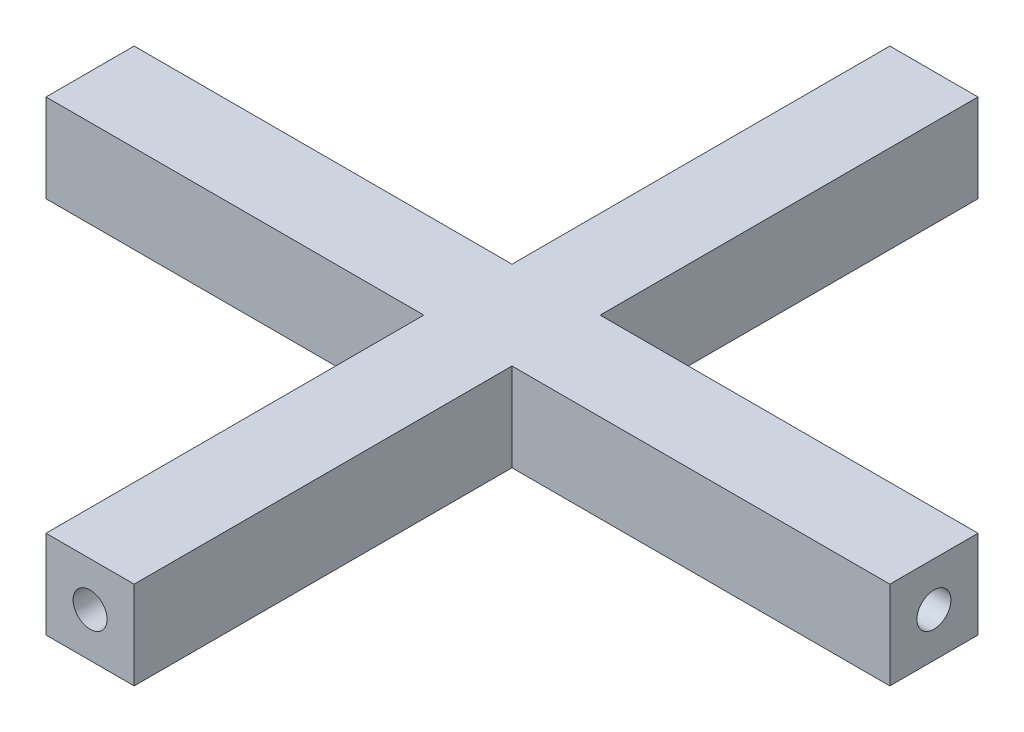
ISO-10303-21;
HEADER;
FILE_DESCRIPTION(('STEP AP214'),'2;1');
FILE_NAME('part.step','',(''),(''),'','','');
FILE_SCHEMA(('AUTOMOTIVE_DESIGN { 1 0 10303 214 1 1 1 1 }'));
ENDSEC;
DATA;
#1=APPLICATION_CONTEXT('core data for automotive mechanical design processes');
#2=APPLICATION_PROTOCOL_DEFINITION('international standard','automotive_design',2000,#1);
#3=PRODUCT_CONTEXT('',#1,'mechanical');
#4=PRODUCT('Part','Part','',(#3));
#5=PRODUCT_RELATED_PRODUCT_CATEGORY('part','',(#4));
#6=PRODUCT_DEFINITION_FORMATION('','',#4);
#7=PRODUCT_DEFINITION_CONTEXT('part definition',#1,'design');
#8=PRODUCT_DEFINITION('design','',#6,#7);
#9=PRODUCT_DEFINITION_SHAPE('','',#8);
#10=(LENGTH_UNIT() NAMED_UNIT(*) SI_UNIT(.MILLI.,.METRE.));
#11=(NAMED_UNIT(*) PLANE_ANGLE_UNIT() SI_UNIT($,.RADIAN.));
#12=(NAMED_UNIT(*) SI_UNIT($,.STERADIAN.) SOLID_ANGLE_UNIT());
#13=UNCERTAINTY_MEASURE_WITH_UNIT(LENGTH_MEASURE(1.E-05),#10,'distance_accuracy_value','');
#14=(GEOMETRIC_REPRESENTATION_CONTEXT(3) GLOBAL_UNCERTAINTY_ASSIGNED_CONTEXT((#13)) GLOBAL_UNIT_ASSIGNED_CONTEXT((#10,
#11,#12)) REPRESENTATION_CONTEXT('',''));
#15=CARTESIAN_POINT('',(0.,0.,0.));
#16=DIRECTION('',(0.,0.,1.));
#17=DIRECTION('',(1.,0.,0.));
#18=AXIS2_PLACEMENT_3D('',#15,#16,#17);
#19=CARTESIAN_POINT('',(-1.75,1.75,16.75));
#20=DIRECTION('',(0.,0.,-1.));
#21=DIRECTION('',(-1.,0.,0.));
#22=AXIS2_PLACEMENT_3D('',#19,#20,#21);
#23=PLANE('',#22);
#24=CARTESIAN_POINT('',(0.,0.,16.75));
#25=DIRECTION('',(0.,0.,-1.));
#26=DIRECTION('',(-1.,0.,0.));
#27=AXIS2_PLACEMENT_3D('',#24,#25,#26);
#28=CIRCLE('',#27,0.675);
#29=CARTESIAN_POINT('',(-0.675,0.,16.75));
#30=VERTEX_POINT('',#29);
#31=EDGE_CURVE('E300',#30,#30,#28,.T.);
#32=ORIENTED_EDGE('',*,*,#31,.T.);
#33=EDGE_LOOP('',(#32));
#34=FACE_BOUND('',#33,.T.);
#35=DIRECTION('',(1.,0.,0.));
#36=VECTOR('',#35,1.);
#37=CARTESIAN_POINT('',(-1.75,-1.75,16.75));
#38=LINE('',#37,#36);
#39=CARTESIAN_POINT('',(-1.75,-1.75,16.75));
#40=VERTEX_POINT('',#39);
#41=CARTESIAN_POINT('',(1.75,-1.75,16.75));
#42=VERTEX_POINT('',#41);
#43=EDGE_CURVE('E164',#40,#42,#38,.T.);
#44=ORIENTED_EDGE('',*,*,#43,.T.);
#45=DIRECTION('',(0.,-1.,0.));
#46=VECTOR('',#45,1.);
#47=CARTESIAN_POINT('',(1.75,1.75,16.75));
#48=LINE('',#47,#46);
#49=CARTESIAN_POINT('',(1.75,1.75,16.75));
#50=VERTEX_POINT('',#49);
#51=EDGE_CURVE('E11',#50,#42,#48,.T.);
#52=ORIENTED_EDGE('',*,*,#51,.F.);
#53=DIRECTION('',(1.,0.,0.));
#54=VECTOR('',#53,1.);
#55=CARTESIAN_POINT('',(-1.75,1.75,16.75));
#56=LINE('',#55,#54);
#57=CARTESIAN_POINT('',(-1.75,1.75,16.75));
#58=VERTEX_POINT('',#57);
#59=EDGE_CURVE('E199',#58,#50,#56,.T.);
#60=ORIENTED_EDGE('',*,*,#59,.F.);
#61=DIRECTION('',(0.,-1.,0.));
#62=VECTOR('',#61,1.);
#63=CARTESIAN_POINT('',(-1.75,1.75,16.75));
#64=LINE('',#63,#62);
#65=EDGE_CURVE('E160',#58,#40,#64,.T.);
#66=ORIENTED_EDGE('',*,*,#65,.T.);
#67=EDGE_LOOP('',(#44,#52,#60,#66));
#68=FACE_BOUND('',#67,.T.);
#69=ADVANCED_FACE('F39',(#34,#68),#23,.F.);
#70=CARTESIAN_POINT('',(1.75,1.75,1.75));
#71=DIRECTION('',(-1.,0.,0.));
#72=DIRECTION('',(0.,0.,1.));
#73=AXIS2_PLACEMENT_3D('',#70,#71,#72);
#74=PLANE('',#73);
#75=DIRECTION('',(0.,0.,-1.));
#76=VECTOR('',#75,1.);
#77=CARTESIAN_POINT('',(1.75,-1.75,1.75));
#78=LINE('',#77,#76);
#79=CARTESIAN_POINT('',(1.75,-1.75,1.75));
#80=VERTEX_POINT('',#79);
#81=EDGE_CURVE('E168',#42,#80,#78,.T.);
#82=ORIENTED_EDGE('',*,*,#81,.T.);
#83=DIRECTION('',(0.,-1.,0.));
#84=VECTOR('',#83,1.);
#85=CARTESIAN_POINT('',(1.75,1.75,1.75));
#86=LINE('',#85,#84);
#87=CARTESIAN_POINT('',(1.75,1.75,1.75));
#88=VERTEX_POINT('',#87);
#89=EDGE_CURVE('E48',#88,#80,#86,.T.);
#90=ORIENTED_EDGE('',*,*,#89,.F.);
#91=DIRECTION('',(0.,0.,-1.));
#92=VECTOR('',#91,1.);
#93=CARTESIAN_POINT('',(1.75,1.75,1.75));
#94=LINE('',#93,#92);
#95=EDGE_CURVE('E111',#50,#88,#94,.T.);
#96=ORIENTED_EDGE('',*,*,#95,.F.);
#97=ORIENTED_EDGE('',*,*,#51,.T.);
#98=EDGE_LOOP('',(#82,#90,#96,#97));
#99=FACE_BOUND('',#98,.T.);
#100=ADVANCED_FACE('F293',(#99),#74,.F.);
#101=CARTESIAN_POINT('',(1.75,1.75,1.75));
#102=DIRECTION('',(0.,0.,-1.));
#103=DIRECTION('',(-1.,0.,0.));
#104=AXIS2_PLACEMENT_3D('',#101,#102,#103);
#105=PLANE('',#104);
#106=DIRECTION('',(1.,0.,0.));
#107=VECTOR('',#106,1.);
#108=CARTESIAN_POINT('',(1.75,-1.75,1.75));
#109=LINE('',#108,#107);
#110=CARTESIAN_POINT('',(16.75,-1.75,1.75));
#111=VERTEX_POINT('',#110);
#112=EDGE_CURVE('E172',#80,#111,#109,.T.);
#113=ORIENTED_EDGE('',*,*,#112,.T.);
#114=DIRECTION('',(0.,-1.,0.));
#115=VECTOR('',#114,1.);
#116=CARTESIAN_POINT('',(16.75,1.75,1.75));
#117=LINE('',#116,#115);
#118=CARTESIAN_POINT('',(16.75,1.75,1.75));
#119=VERTEX_POINT('',#118);
#120=EDGE_CURVE('E226',#119,#111,#117,.T.);
#121=ORIENTED_EDGE('',*,*,#120,.F.);
#122=DIRECTION('',(1.,0.,0.));
#123=VECTOR('',#122,1.);
#124=CARTESIAN_POINT('',(1.75,1.75,1.75));
#125=LINE('',#124,#123);
#126=EDGE_CURVE('E236',#88,#119,#125,.T.);
#127=ORIENTED_EDGE('',*,*,#126,.F.);
#128=ORIENTED_EDGE('',*,*,#89,.T.);
#129=EDGE_LOOP('',(#113,#121,#127,#128));
#130=FACE_BOUND('',#129,.T.);
#131=ADVANCED_FACE('F234',(#130),#105,.F.);
#132=CARTESIAN_POINT('',(16.75,1.75,-1.75));
#133=DIRECTION('',(-1.,0.,0.));
#134=DIRECTION('',(0.,0.,1.));
#135=AXIS2_PLACEMENT_3D('',#132,#133,#134);
#136=PLANE('',#135);
#137=CARTESIAN_POINT('',(16.75,0.,0.));
#138=DIRECTION('',(-1.,0.,0.));
#139=DIRECTION('',(0.,0.,1.));
#140=AXIS2_PLACEMENT_3D('',#137,#138,#139);
#141=CIRCLE('',#140,0.675);
#142=CARTESIAN_POINT('',(16.75,0.,0.675));
#143=VERTEX_POINT('',#142);
#144=EDGE_CURVE('E455',#143,#143,#141,.T.);
#145=ORIENTED_EDGE('',*,*,#144,.T.);
#146=EDGE_LOOP('',(#145));
#147=FACE_BOUND('',#146,.T.);
#148=DIRECTION('',(0.,0.,-1.));
#149=VECTOR('',#148,1.);
#150=CARTESIAN_POINT('',(16.75,-1.75,-1.75));
#151=LINE('',#150,#149);
#152=CARTESIAN_POINT('',(16.75,-1.75,-1.75));
#153=VERTEX_POINT('',#152);
#154=EDGE_CURVE('E175',#111,#153,#151,.T.);
#155=ORIENTED_EDGE('',*,*,#154,.T.);
#156=DIRECTION('',(0.,-1.,0.));
#157=VECTOR('',#156,1.);
#158=CARTESIAN_POINT('',(16.75,1.75,-1.75));
#159=LINE('',#158,#157);
#160=CARTESIAN_POINT('',(16.75,1.75,-1.75));
#161=VERTEX_POINT('',#160);
#162=EDGE_CURVE('E222',#161,#153,#159,.T.);
#163=ORIENTED_EDGE('',*,*,#162,.F.);
#164=DIRECTION('',(0.,0.,-1.));
#165=VECTOR('',#164,1.);
#166=CARTESIAN_POINT('',(16.75,1.75,-1.75));
#167=LINE('',#166,#165);
#168=EDGE_CURVE('E255',#119,#161,#167,.T.);
#169=ORIENTED_EDGE('',*,*,#168,.F.);
#170=ORIENTED_EDGE('',*,*,#120,.T.);
#171=EDGE_LOOP('',(#155,#163,#169,#170));
#172=FACE_BOUND('',#171,.T.);
#173=ADVANCED_FACE('F245',(#147,#172),#136,.F.);
#174=CARTESIAN_POINT('',(1.75,1.75,-1.75));
#175=DIRECTION('',(0.,0.,1.));
#176=DIRECTION('',(1.,0.,0.));
#177=AXIS2_PLACEMENT_3D('',#174,#175,#176);
#178=PLANE('',#177);
#179=DIRECTION('',(-1.,0.,0.));
#180=VECTOR('',#179,1.);
#181=CARTESIAN_POINT('',(1.75,-1.75,-1.75));
#182=LINE('',#181,#180);
#183=CARTESIAN_POINT('',(1.75,-1.75,-1.75));
#184=VERTEX_POINT('',#183);
#185=EDGE_CURVE('E178',#153,#184,#182,.T.);
#186=ORIENTED_EDGE('',*,*,#185,.T.);
#187=DIRECTION('',(0.,-1.,0.));
#188=VECTOR('',#187,1.);
#189=CARTESIAN_POINT('',(1.75,1.75,-1.75));
#190=LINE('',#189,#188);
#191=CARTESIAN_POINT('',(1.75,1.75,-1.75));
#192=VERTEX_POINT('',#191);
#193=EDGE_CURVE('E218',#192,#184,#190,.T.);
#194=ORIENTED_EDGE('',*,*,#193,.F.);
#195=DIRECTION('',(-1.,0.,0.));
#196=VECTOR('',#195,1.);
#197=CARTESIAN_POINT('',(1.75,1.75,-1.75));
#198=LINE('',#197,#196);
#199=EDGE_CURVE('E251',#161,#192,#198,.T.);
#200=ORIENTED_EDGE('',*,*,#199,.F.);
#201=ORIENTED_EDGE('',*,*,#162,.T.);
#202=EDGE_LOOP('',(#186,#194,#200,#201));
#203=FACE_BOUND('',#202,.T.);
#204=ADVANCED_FACE('F249',(#203),#178,.F.);
#205=CARTESIAN_POINT('',(1.75,1.75,-16.75));
#206=DIRECTION('',(-1.,0.,0.));
#207=DIRECTION('',(0.,0.,1.));
#208=AXIS2_PLACEMENT_3D('',#205,#206,#207);
#209=PLANE('',#208);
#210=DIRECTION('',(0.,0.,-1.));
#211=VECTOR('',#210,1.);
#212=CARTESIAN_POINT('',(1.75,-1.75,-16.75));
#213=LINE('',#212,#211);
#214=CARTESIAN_POINT('',(1.75,-1.75,-16.75));
#215=VERTEX_POINT('',#214);
#216=EDGE_CURVE('E181',#184,#215,#213,.T.);
#217=ORIENTED_EDGE('',*,*,#216,.T.);
#218=DIRECTION('',(0.,-1.,0.));
#219=VECTOR('',#218,1.);
#220=CARTESIAN_POINT('',(1.75,1.75,-16.75));
#221=LINE('',#220,#219);
#222=CARTESIAN_POINT('',(1.75,1.75,-16.75));
#223=VERTEX_POINT('',#222);
#224=EDGE_CURVE('E214',#223,#215,#221,.T.);
#225=ORIENTED_EDGE('',*,*,#224,.F.);
#226=DIRECTION('',(0.,0.,-1.));
#227=VECTOR('',#226,1.);
#228=CARTESIAN_POINT('',(1.75,1.75,-16.75));
#229=LINE('',#228,#227);
#230=EDGE_CURVE('E254',#192,#223,#229,.T.);
#231=ORIENTED_EDGE('',*,*,#230,.F.);
#232=ORIENTED_EDGE('',*,*,#193,.T.);
#233=EDGE_LOOP('',(#217,#225,#231,#232));
#234=FACE_BOUND('',#233,.T.);
#235=ADVANCED_FACE('F473',(#234),#209,.F.);
#236=CARTESIAN_POINT('',(-1.75,1.75,-16.75));
#237=DIRECTION('',(0.,0.,1.));
#238=DIRECTION('',(1.,0.,0.));
#239=AXIS2_PLACEMENT_3D('',#236,#237,#238);
#240=PLANE('',#239);
#241=CARTESIAN_POINT('',(0.,0.,-16.75));
#242=DIRECTION('',(0.,0.,1.));
#243=DIRECTION('',(1.,0.,0.));
#244=AXIS2_PLACEMENT_3D('',#241,#242,#243);
#245=CIRCLE('',#244,0.675);
#246=CARTESIAN_POINT('',(0.675,0.,-16.75));
#247=VERTEX_POINT('',#246);
#248=EDGE_CURVE('E169',#247,#247,#245,.T.);
#249=ORIENTED_EDGE('',*,*,#248,.T.);
#250=EDGE_LOOP('',(#249));
#251=FACE_BOUND('',#250,.T.);
#252=DIRECTION('',(-1.,0.,0.));
#253=VECTOR('',#252,1.);
#254=CARTESIAN_POINT('',(-1.75,-1.75,-16.75));
#255=LINE('',#254,#253);
#256=CARTESIAN_POINT('',(-1.75,-1.75,-16.75));
#257=VERTEX_POINT('',#256);
#258=EDGE_CURVE('E184',#215,#257,#255,.T.);
#259=ORIENTED_EDGE('',*,*,#258,.T.);
#260=DIRECTION('',(0.,-1.,0.));
#261=VECTOR('',#260,1.);
#262=CARTESIAN_POINT('',(-1.75,1.75,-16.75));
#263=LINE('',#262,#261);
#264=CARTESIAN_POINT('',(-1.75,1.75,-16.75));
#265=VERTEX_POINT('',#264);
#266=EDGE_CURVE('E210',#265,#257,#263,.T.);
#267=ORIENTED_EDGE('',*,*,#266,.F.);
#268=DIRECTION('',(-1.,0.,0.));
#269=VECTOR('',#268,1.);
#270=CARTESIAN_POINT('',(-1.75,1.75,-16.75));
#271=LINE('',#270,#269);
#272=EDGE_CURVE('E259',#223,#265,#271,.T.);
#273=ORIENTED_EDGE('',*,*,#272,.F.);
#274=ORIENTED_EDGE('',*,*,#224,.T.);
#275=EDGE_LOOP('',(#259,#267,#273,#274));
#276=FACE_BOUND('',#275,.T.);
#277=ADVANCED_FACE('F326',(#251,#276),#240,.F.);
#278=CARTESIAN_POINT('',(-1.75,1.75,-16.75));
#279=DIRECTION('',(1.,0.,0.));
#280=DIRECTION('',(0.,0.,-1.));
#281=AXIS2_PLACEMENT_3D('',#278,#279,#280);
#282=PLANE('',#281);
#283=DIRECTION('',(0.,0.,1.));
#284=VECTOR('',#283,1.);
#285=CARTESIAN_POINT('',(-1.75,-1.75,-16.75));
#286=LINE('',#285,#284);
#287=CARTESIAN_POINT('',(-1.75,-1.75,-1.75));
#288=VERTEX_POINT('',#287);
#289=EDGE_CURVE('E187',#257,#288,#286,.T.);
#290=ORIENTED_EDGE('',*,*,#289,.T.);
#291=DIRECTION('',(0.,-1.,0.));
#292=VECTOR('',#291,1.);
#293=CARTESIAN_POINT('',(-1.75,1.75,-1.75));
#294=LINE('',#293,#292);
#295=CARTESIAN_POINT('',(-1.75,1.75,-1.75));
#296=VERTEX_POINT('',#295);
#297=EDGE_CURVE('E206',#296,#288,#294,.T.);
#298=ORIENTED_EDGE('',*,*,#297,.F.);
#299=DIRECTION('',(0.,0.,1.));
#300=VECTOR('',#299,1.);
#301=CARTESIAN_POINT('',(-1.75,1.75,-16.75));
#302=LINE('',#301,#300);
#303=EDGE_CURVE('E266',#265,#296,#302,.T.);
#304=ORIENTED_EDGE('',*,*,#303,.F.);
#305=ORIENTED_EDGE('',*,*,#266,.T.);
#306=EDGE_LOOP('',(#290,#298,#304,#305));
#307=FACE_BOUND('',#306,.T.);
#308=ADVANCED_FACE('F274',(#307),#282,.F.);
#309=CARTESIAN_POINT('',(-16.75,1.75,-1.75));
#310=DIRECTION('',(0.,0.,1.));
#311=DIRECTION('',(1.,0.,0.));
#312=AXIS2_PLACEMENT_3D('',#309,#310,#311);
#313=PLANE('',#312);
#314=DIRECTION('',(-1.,0.,0.));
#315=VECTOR('',#314,1.);
#316=CARTESIAN_POINT('',(-16.75,-1.75,-1.75));
#317=LINE('',#316,#315);
#318=CARTESIAN_POINT('',(-16.75,-1.75,-1.75));
#319=VERTEX_POINT('',#318);
#320=EDGE_CURVE('E190',#288,#319,#317,.T.);
#321=ORIENTED_EDGE('',*,*,#320,.T.);
#322=DIRECTION('',(0.,-1.,0.));
#323=VECTOR('',#322,1.);
#324=CARTESIAN_POINT('',(-16.75,1.75,-1.75));
#325=LINE('',#324,#323);
#326=CARTESIAN_POINT('',(-16.75,1.75,-1.75));
#327=VERTEX_POINT('',#326);
#328=EDGE_CURVE('E153',#327,#319,#325,.T.);
#329=ORIENTED_EDGE('',*,*,#328,.F.);
#330=DIRECTION('',(-1.,0.,0.));
#331=VECTOR('',#330,1.);
#332=CARTESIAN_POINT('',(-16.75,1.75,-1.75));
#333=LINE('',#332,#331);
#334=EDGE_CURVE('E142',#296,#327,#333,.T.);
#335=ORIENTED_EDGE('',*,*,#334,.F.);
#336=ORIENTED_EDGE('',*,*,#297,.T.);
#337=EDGE_LOOP('',(#321,#329,#335,#336));
#338=FACE_BOUND('',#337,.T.);
#339=ADVANCED_FACE('F278',(#338),#313,.F.);
#340=CARTESIAN_POINT('',(-16.75,1.75,-1.75));
#341=DIRECTION('',(1.,0.,0.));
#342=DIRECTION('',(0.,0.,-1.));
#343=AXIS2_PLACEMENT_3D('',#340,#341,#342);
#344=PLANE('',#343);
#345=CARTESIAN_POINT('',(-16.75,0.,0.));
#346=DIRECTION('',(1.,0.,0.));
#347=DIRECTION('',(0.,0.,-1.));
#348=AXIS2_PLACEMENT_3D('',#345,#346,#347);
#349=CIRCLE('',#348,0.675);
#350=CARTESIAN_POINT('',(-16.75,0.,-0.675));
#351=VERTEX_POINT('',#350);
#352=EDGE_CURVE('E311',#351,#351,#349,.T.);
#353=ORIENTED_EDGE('',*,*,#352,.T.);
#354=EDGE_LOOP('',(#353));
#355=FACE_BOUND('',#354,.T.);
#356=DIRECTION('',(0.,0.,1.));
#357=VECTOR('',#356,1.);
#358=CARTESIAN_POINT('',(-16.75,-1.75,-1.75));
#359=LINE('',#358,#357);
#360=CARTESIAN_POINT('',(-16.75,-1.75,1.75));
#361=VERTEX_POINT('',#360);
#362=EDGE_CURVE('E151',#319,#361,#359,.T.);
#363=ORIENTED_EDGE('',*,*,#362,.T.);
#364=DIRECTION('',(0.,-1.,0.));
#365=VECTOR('',#364,1.);
#366=CARTESIAN_POINT('',(-16.75,1.75,1.75));
#367=LINE('',#366,#365);
#368=CARTESIAN_POINT('',(-16.75,1.75,1.75));
#369=VERTEX_POINT('',#368);
#370=EDGE_CURVE('E148',#369,#361,#367,.T.);
#371=ORIENTED_EDGE('',*,*,#370,.F.);
#372=DIRECTION('',(0.,0.,1.));
#373=VECTOR('',#372,1.);
#374=CARTESIAN_POINT('',(-16.75,1.75,-1.75));
#375=LINE('',#374,#373);
#376=EDGE_CURVE('E136',#327,#369,#375,.T.);
#377=ORIENTED_EDGE('',*,*,#376,.F.);
#378=ORIENTED_EDGE('',*,*,#328,.T.);
#379=EDGE_LOOP('',(#363,#371,#377,#378));
#380=FACE_BOUND('',#379,.T.);
#381=ADVANCED_FACE('F149',(#355,#380),#344,.F.);
#382=CARTESIAN_POINT('',(-16.75,1.75,1.75));
#383=DIRECTION('',(0.,0.,-1.));
#384=DIRECTION('',(-1.,0.,0.));
#385=AXIS2_PLACEMENT_3D('',#382,#383,#384);
#386=PLANE('',#385);
#387=DIRECTION('',(1.,0.,0.));
#388=VECTOR('',#387,1.);
#389=CARTESIAN_POINT('',(-16.75,-1.75,1.75));
#390=LINE('',#389,#388);
#391=CARTESIAN_POINT('',(-1.75,-1.75,1.75));
#392=VERTEX_POINT('',#391);
#393=EDGE_CURVE('E97',#361,#392,#390,.T.);
#394=ORIENTED_EDGE('',*,*,#393,.T.);
#395=DIRECTION('',(0.,-1.,0.));
#396=VECTOR('',#395,1.);
#397=CARTESIAN_POINT('',(-1.75,1.75,1.75));
#398=LINE('',#397,#396);
#399=CARTESIAN_POINT('',(-1.75,1.75,1.75));
#400=VERTEX_POINT('',#399);
#401=EDGE_CURVE('E154',#400,#392,#398,.T.);
#402=ORIENTED_EDGE('',*,*,#401,.F.);
#403=DIRECTION('',(1.,0.,0.));
#404=VECTOR('',#403,1.);
#405=CARTESIAN_POINT('',(-16.75,1.75,1.75));
#406=LINE('',#405,#404);
#407=EDGE_CURVE('E140',#369,#400,#406,.T.);
#408=ORIENTED_EDGE('',*,*,#407,.F.);
#409=ORIENTED_EDGE('',*,*,#370,.T.);
#410=EDGE_LOOP('',(#394,#402,#408,#409));
#411=FACE_BOUND('',#410,.T.);
#412=ADVANCED_FACE('F156',(#411),#386,.F.);
#413=CARTESIAN_POINT('',(-1.75,1.75,1.75));
#414=DIRECTION('',(1.,0.,0.));
#415=DIRECTION('',(0.,0.,-1.));
#416=AXIS2_PLACEMENT_3D('',#413,#414,#415);
#417=PLANE('',#416);
#418=DIRECTION('',(0.,0.,1.));
#419=VECTOR('',#418,1.);
#420=CARTESIAN_POINT('',(-1.75,-1.75,1.75));
#421=LINE('',#420,#419);
#422=EDGE_CURVE('E103',#392,#40,#421,.T.);
#423=ORIENTED_EDGE('',*,*,#422,.T.);
#424=ORIENTED_EDGE('',*,*,#65,.F.);
#425=DIRECTION('',(0.,0.,1.));
#426=VECTOR('',#425,1.);
#427=CARTESIAN_POINT('',(-1.75,1.75,1.75));
#428=LINE('',#427,#426);
#429=EDGE_CURVE('E56',#400,#58,#428,.T.);
#430=ORIENTED_EDGE('',*,*,#429,.F.);
#431=ORIENTED_EDGE('',*,*,#401,.T.);
#432=EDGE_LOOP('',(#423,#424,#430,#431));
#433=FACE_BOUND('',#432,.T.);
#434=ADVANCED_FACE('F282',(#433),#417,.F.);
#435=CARTESIAN_POINT('',(0.,1.75,0.));
#436=DIRECTION('',(0.,-1.,0.));
#437=DIRECTION('',(0.,0.,-1.));
#438=AXIS2_PLACEMENT_3D('',#435,#436,#437);
#439=PLANE('',#438);
#440=ORIENTED_EDGE('',*,*,#59,.T.);
#441=ORIENTED_EDGE('',*,*,#95,.T.);
#442=ORIENTED_EDGE('',*,*,#126,.T.);
#443=ORIENTED_EDGE('',*,*,#168,.T.);
#444=ORIENTED_EDGE('',*,*,#199,.T.);
#445=ORIENTED_EDGE('',*,*,#230,.T.);
#446=ORIENTED_EDGE('',*,*,#272,.T.);
#447=ORIENTED_EDGE('',*,*,#303,.T.);
#448=ORIENTED_EDGE('',*,*,#334,.T.);
#449=ORIENTED_EDGE('',*,*,#376,.T.);
#450=ORIENTED_EDGE('',*,*,#407,.T.);
#451=ORIENTED_EDGE('',*,*,#429,.T.);
#452=EDGE_LOOP('',(#440,#441,#442,#443,#444,#445,#446,#447,#448,#449,#450,#451));
#453=FACE_BOUND('',#452,.T.);
#454=ADVANCED_FACE('F138',(#453),#439,.F.);
#455=CARTESIAN_POINT('',(0.,-1.75,0.));
#456=DIRECTION('',(0.,-1.,0.));
#457=DIRECTION('',(0.,0.,-1.));
#458=AXIS2_PLACEMENT_3D('',#455,#456,#457);
#459=PLANE('',#458);
#460=ORIENTED_EDGE('',*,*,#43,.F.);
#461=ORIENTED_EDGE('',*,*,#422,.F.);
#462=ORIENTED_EDGE('',*,*,#393,.F.);
#463=ORIENTED_EDGE('',*,*,#362,.F.);
#464=ORIENTED_EDGE('',*,*,#320,.F.);
#465=ORIENTED_EDGE('',*,*,#289,.F.);
#466=ORIENTED_EDGE('',*,*,#258,.F.);
#467=ORIENTED_EDGE('',*,*,#216,.F.);
#468=ORIENTED_EDGE('',*,*,#185,.F.);
#469=ORIENTED_EDGE('',*,*,#154,.F.);
#470=ORIENTED_EDGE('',*,*,#112,.F.);
#471=ORIENTED_EDGE('',*,*,#81,.F.);
#472=EDGE_LOOP('',(#460,#461,#462,#463,#464,#465,#466,#467,#468,#469,#470,#471));
#473=FACE_BOUND('',#472,.T.);
#474=ADVANCED_FACE('F240',(#473),#459,.T.);
#475=CARTESIAN_POINT('',(0.,0.,-16.75));
#476=DIRECTION('',(0.,0.,1.));
#477=DIRECTION('',(1.,0.,0.));
#478=AXIS2_PLACEMENT_3D('',#475,#476,#477);
#479=CYLINDRICAL_SURFACE('',#478,0.675);
#480=ORIENTED_EDGE('',*,*,#248,.F.);
#481=EDGE_LOOP('',(#480));
#482=FACE_BOUND('',#481,.T.);
#483=CARTESIAN_POINT('',(0.,0.,-1.75));
#484=DIRECTION('',(0.,0.,1.));
#485=DIRECTION('',(1.,0.,0.));
#486=AXIS2_PLACEMENT_3D('',#483,#484,#485);
#487=CIRCLE('',#486,0.675);
#488=CARTESIAN_POINT('',(0.675,0.,-1.75));
#489=VERTEX_POINT('',#488);
#490=EDGE_CURVE('E303',#489,#489,#487,.T.);
#491=ORIENTED_EDGE('',*,*,#490,.T.);
#492=EDGE_LOOP('',(#491));
#493=FACE_BOUND('',#492,.T.);
#494=ADVANCED_FACE('F329',(#482,#493),#479,.F.);
#495=CARTESIAN_POINT('',(0.,0.,-1.75));
#496=DIRECTION('',(0.,0.,1.));
#497=DIRECTION('',(1.,0.,0.));
#498=AXIS2_PLACEMENT_3D('',#495,#496,#497);
#499=PLANE('',#498);
#500=ORIENTED_EDGE('',*,*,#490,.F.);
#501=EDGE_LOOP('',(#500));
#502=FACE_BOUND('',#501,.T.);
#503=ADVANCED_FACE('F332',(#502),#499,.F.);
#504=CARTESIAN_POINT('',(0.,0.,16.75));
#505=DIRECTION('',(0.,0.,-1.));
#506=DIRECTION('',(-1.,0.,0.));
#507=AXIS2_PLACEMENT_3D('',#504,#505,#506);
#508=CYLINDRICAL_SURFACE('',#507,0.675);
#509=ORIENTED_EDGE('',*,*,#31,.F.);
#510=EDGE_LOOP('',(#509));
#511=FACE_BOUND('',#510,.T.);
#512=CARTESIAN_POINT('',(0.,0.,1.75));
#513=DIRECTION('',(0.,0.,-1.));
#514=DIRECTION('',(-1.,0.,0.));
#515=AXIS2_PLACEMENT_3D('',#512,#513,#514);
#516=CIRCLE('',#515,0.675);
#517=CARTESIAN_POINT('',(-0.675,0.,1.75));
#518=VERTEX_POINT('',#517);
#519=EDGE_CURVE('E304',#518,#518,#516,.T.);
#520=ORIENTED_EDGE('',*,*,#519,.T.);
#521=EDGE_LOOP('',(#520));
#522=FACE_BOUND('',#521,.T.);
#523=ADVANCED_FACE('F337',(#511,#522),#508,.F.);
#524=CARTESIAN_POINT('',(0.,0.,1.75));
#525=DIRECTION('',(0.,0.,-1.));
#526=DIRECTION('',(-1.,0.,0.));
#527=AXIS2_PLACEMENT_3D('',#524,#525,#526);
#528=PLANE('',#527);
#529=ORIENTED_EDGE('',*,*,#519,.F.);
#530=EDGE_LOOP('',(#529));
#531=FACE_BOUND('',#530,.T.);
#532=ADVANCED_FACE('F342',(#531),#528,.F.);
#533=CARTESIAN_POINT('',(-16.75,0.,0.));
#534=DIRECTION('',(1.,0.,0.));
#535=DIRECTION('',(0.,0.,-1.));
#536=AXIS2_PLACEMENT_3D('',#533,#534,#535);
#537=CYLINDRICAL_SURFACE('',#536,0.675);
#538=ORIENTED_EDGE('',*,*,#352,.F.);
#539=EDGE_LOOP('',(#538));
#540=FACE_BOUND('',#539,.T.);
#541=CARTESIAN_POINT('',(-1.75,0.,0.));
#542=DIRECTION('',(1.,0.,0.));
#543=DIRECTION('',(0.,0.,-1.));
#544=AXIS2_PLACEMENT_3D('',#541,#542,#543);
#545=CIRCLE('',#544,0.675);
#546=CARTESIAN_POINT('',(-1.75,0.,-0.675));
#547=VERTEX_POINT('',#546);
#548=EDGE_CURVE('E314',#547,#547,#545,.T.);
#549=ORIENTED_EDGE('',*,*,#548,.T.);
#550=EDGE_LOOP('',(#549));
#551=FACE_BOUND('',#550,.T.);
#552=ADVANCED_FACE('F382',(#540,#551),#537,.F.);
#553=CARTESIAN_POINT('',(-1.75,0.,0.));
#554=DIRECTION('',(1.,0.,0.));
#555=DIRECTION('',(0.,0.,-1.));
#556=AXIS2_PLACEMENT_3D('',#553,#554,#555);
#557=PLANE('',#556);
#558=ORIENTED_EDGE('',*,*,#548,.F.);
#559=EDGE_LOOP('',(#558));
#560=FACE_BOUND('',#559,.T.);
#561=ADVANCED_FACE('F403',(#560),#557,.F.);
#562=CARTESIAN_POINT('',(16.75,0.,0.));
#563=DIRECTION('',(-1.,0.,0.));
#564=DIRECTION('',(0.,0.,1.));
#565=AXIS2_PLACEMENT_3D('',#562,#563,#564);
#566=CYLINDRICAL_SURFACE('',#565,0.675);
#567=ORIENTED_EDGE('',*,*,#144,.F.);
#568=EDGE_LOOP('',(#567));
#569=FACE_BOUND('',#568,.T.);
#570=CARTESIAN_POINT('',(1.75,0.,0.));
#571=DIRECTION('',(-1.,0.,0.));
#572=DIRECTION('',(0.,0.,1.));
#573=AXIS2_PLACEMENT_3D('',#570,#571,#572);
#574=CIRCLE('',#573,0.675);
#575=CARTESIAN_POINT('',(1.75,0.,0.675));
#576=VERTEX_POINT('',#575);
#577=EDGE_CURVE('E452',#576,#576,#574,.T.);
#578=ORIENTED_EDGE('',*,*,#577,.T.);
#579=EDGE_LOOP('',(#578));
#580=FACE_BOUND('',#579,.T.);
#581=ADVANCED_FACE('F413',(#569,#580),#566,.F.);
#582=CARTESIAN_POINT('',(1.75,0.,0.));
#583=DIRECTION('',(-1.,0.,0.));
#584=DIRECTION('',(0.,0.,1.));
#585=AXIS2_PLACEMENT_3D('',#582,#583,#584);
#586=PLANE('',#585);
#587=ORIENTED_EDGE('',*,*,#577,.F.);
#588=EDGE_LOOP('',(#587));
#589=FACE_BOUND('',#588,.T.);
#590=ADVANCED_FACE('F436',(#589),#586,.F.);
#591=CLOSED_SHELL('',(#69,#100,#131,#173,#204,#235,#277,#308,#339,#381,#412,#434,#454,#474,#494,
#503,#523,#532,#552,#561,#581,#590));
#592=MANIFOLD_SOLID_BREP('B2',#591);
#593=ADVANCED_BREP_SHAPE_REPRESENTATION('',(#18,#592),#14);
#594=SHAPE_DEFINITION_REPRESENTATION(#9,#593);
ENDSEC;
END-ISO-10303-21;
